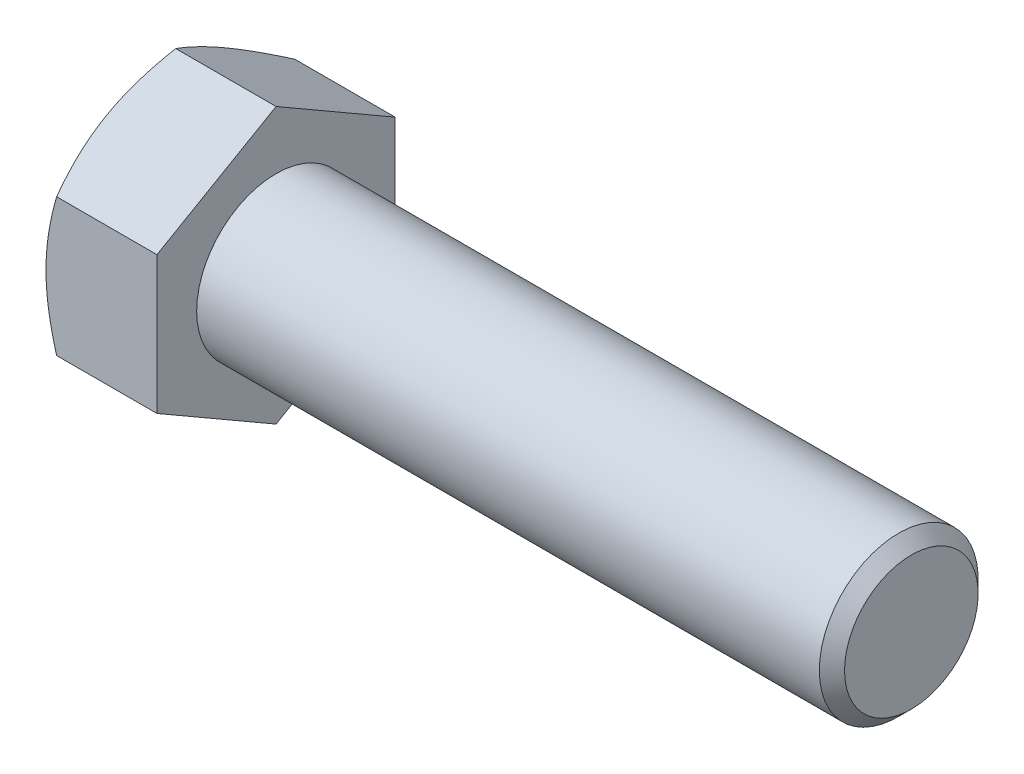
ISO-10303-21;
HEADER;
FILE_DESCRIPTION(('STEP AP214'),'2;1');
FILE_NAME('part.step','',(''),(''),'','','');
FILE_SCHEMA(('AUTOMOTIVE_DESIGN { 1 0 10303 214 1 1 1 1 }'));
ENDSEC;
DATA;
#1=APPLICATION_CONTEXT('core data for automotive mechanical design processes');
#2=APPLICATION_PROTOCOL_DEFINITION('international standard','automotive_design',2000,#1);
#3=PRODUCT_CONTEXT('',#1,'mechanical');
#4=PRODUCT('Part','Part','',(#3));
#5=PRODUCT_RELATED_PRODUCT_CATEGORY('part','',(#4));
#6=PRODUCT_DEFINITION_FORMATION('','',#4);
#7=PRODUCT_DEFINITION_CONTEXT('part definition',#1,'design');
#8=PRODUCT_DEFINITION('design','',#6,#7);
#9=PRODUCT_DEFINITION_SHAPE('','',#8);
#10=(LENGTH_UNIT() NAMED_UNIT(*) SI_UNIT(.MILLI.,.METRE.));
#11=(NAMED_UNIT(*) PLANE_ANGLE_UNIT() SI_UNIT($,.RADIAN.));
#12=(NAMED_UNIT(*) SI_UNIT($,.STERADIAN.) SOLID_ANGLE_UNIT());
#13=UNCERTAINTY_MEASURE_WITH_UNIT(LENGTH_MEASURE(1.E-05),#10,'distance_accuracy_value','');
#14=(GEOMETRIC_REPRESENTATION_CONTEXT(3) GLOBAL_UNCERTAINTY_ASSIGNED_CONTEXT((#13)) GLOBAL_UNIT_ASSIGNED_CONTEXT((#10,
#11,#12)) REPRESENTATION_CONTEXT('',''));
#15=CARTESIAN_POINT('',(0.,0.,0.));
#16=DIRECTION('',(0.,0.,1.));
#17=DIRECTION('',(1.,0.,0.));
#18=AXIS2_PLACEMENT_3D('',#15,#16,#17);
#19=CARTESIAN_POINT('',(13.3096,8.24889197104677,-14.2875));
#20=DIRECTION('',(0.,-0.866025403784438,0.5));
#21=DIRECTION('',(0.,-0.5,-0.866025403784438));
#22=AXIS2_PLACEMENT_3D('',#19,#20,#21);
#23=PLANE('',#22);
#24=CARTESIAN_POINT('',(1.2761746963198,16.4978994121474,0.0002));
#25=CARTESIAN_POINT('',(1.17150354049374,16.316591962665,-0.313833714294314));
#26=CARTESIAN_POINT('',(1.07158215537579,16.1345773166767,-0.629092328867607));
#27=CARTESIAN_POINT('',(0.882559201585307,15.7690884807822,-1.26213756223605));
#28=CARTESIAN_POINT('',(0.793461191524302,15.5856138318553,-1.5799249760784));
#29=CARTESIAN_POINT('',(0.627282646740068,15.2168504028066,-2.21864197116398));
#30=CARTESIAN_POINT('',(0.550230545696853,15.0315583957425,-2.53957714163546));
#31=CARTESIAN_POINT('',(0.409798352887989,14.6596868248225,-3.18367759635941));
#32=CARTESIAN_POINT('',(0.346417481149996,14.4731073350473,-3.50684275230036));
#33=CARTESIAN_POINT('',(0.236023554267069,14.1034416805247,-4.14712244774659));
#34=CARTESIAN_POINT('',(0.188645115273865,13.9203829601652,-4.46418945217785));
#35=CARTESIAN_POINT('',(0.109201912674412,13.5534267067704,-5.09977632721271));
#36=CARTESIAN_POINT('',(0.0771374438271076,13.3695291576584,-5.41829622566207));
#37=CARTESIAN_POINT('',(0.0291317909883735,13.0014251352584,-6.05587109492942));
#38=CARTESIAN_POINT('',(0.0131714475146437,12.8172192908535,-6.37492497648983));
#39=CARTESIAN_POINT('',(-0.00228271550063057,12.448637559964,-7.01332726113216));
#40=CARTESIAN_POINT('',(-0.00177704383827127,12.2642616789095,-7.33267565480881));
#41=CARTESIAN_POINT('',(0.0145506803037095,11.9195719861559,-7.92969571550333));
#42=CARTESIAN_POINT('',(0.0283811431962141,11.759233611051,-8.20740992758799));
#43=CARTESIAN_POINT('',(0.0682339694513751,11.4389256760858,-8.76219954501513));
#44=CARTESIAN_POINT('',(0.0942571951847596,11.2789561431174,-9.03927490377954));
#45=CARTESIAN_POINT('',(0.158041814881286,10.9594727825021,-9.59263631653807));
#46=CARTESIAN_POINT('',(0.195812903582829,10.7999594414437,-9.86892152773624));
#47=CARTESIAN_POINT('',(0.282430562472694,10.4816805882453,-10.4201966724507));
#48=CARTESIAN_POINT('',(0.331277885597339,10.3229151276936,-10.6951865166133));
#49=CARTESIAN_POINT('',(0.495669002146555,9.84097374681805,-11.5299334745597));
#50=CARTESIAN_POINT('',(0.627604309461495,9.51919345055701,-12.0872732965584));
#51=CARTESIAN_POINT('',(0.927043495545048,8.88043099732144,-13.1936423195297));
#52=CARTESIAN_POINT('',(1.09447704990011,8.56344066203608,-13.7426856857522));
#53=CARTESIAN_POINT('',(1.27617469631978,8.24877650099293,-14.2877));
#54=B_SPLINE_CURVE_WITH_KNOTS('',3,(#24,#25,#26,#27,#28,#29,#30,#31,#32,#33,#34,#35,#36,#37,#38,
#39,#40,#41,#42,#43,#44,#45,#46,#47,#48,#49,#50,#51,#52,#53),.UNSPECIFIED.,.F.,.F.,(4,2,2,2,2,2,
2,2,2,2,2,2,2,2,4),(0.,1.1322886698782,2.26494862244556,3.40024304981971,4.53547268912058,
5.64268215336774,6.74991292800918,7.85582484363027,8.9617025868589,9.92439507576008,
10.8871556643353,11.8507128733959,12.8143356024524,14.7839571212635,16.7497125507192),.UNSPECIFIED.);
#55=CARTESIAN_POINT('',(1.27610802895322,16.4977839420936,0.));
#56=VERTEX_POINT('',#55);
#57=CARTESIAN_POINT('',(0.,12.3733379565702,-7.14375));
#58=VERTEX_POINT('',#57);
#59=EDGE_CURVE('E33',#56,#58,#54,.T.);
#60=ORIENTED_EDGE('',*,*,#59,.F.);
#61=DIRECTION('',(-1.,0.,0.));
#62=VECTOR('',#61,1.);
#63=CARTESIAN_POINT('',(13.3096,16.4977839420936,0.));
#64=LINE('',#63,#62);
#65=CARTESIAN_POINT('',(13.3096,16.4977839420936,0.));
#66=VERTEX_POINT('',#65);
#67=EDGE_CURVE('E129',#66,#56,#64,.T.);
#68=ORIENTED_EDGE('',*,*,#67,.F.);
#69=DIRECTION('',(0.,0.5,0.866025403784438));
#70=VECTOR('',#69,1.);
#71=CARTESIAN_POINT('',(13.3096,8.24889197104677,-14.2875));
#72=LINE('',#71,#70);
#73=CARTESIAN_POINT('',(13.3096,8.24889197104677,-14.2875));
#74=VERTEX_POINT('',#73);
#75=EDGE_CURVE('E214',#74,#66,#72,.T.);
#76=ORIENTED_EDGE('',*,*,#75,.F.);
#77=DIRECTION('',(-1.,0.,0.));
#78=VECTOR('',#77,1.);
#79=CARTESIAN_POINT('',(13.3096,8.24889197104677,-14.2875));
#80=LINE('',#79,#78);
#81=CARTESIAN_POINT('',(1.27610802895321,8.24889197104677,-14.2875));
#82=VERTEX_POINT('',#81);
#83=EDGE_CURVE('E117',#74,#82,#80,.T.);
#84=ORIENTED_EDGE('',*,*,#83,.T.);
#85=EDGE_CURVE('E111',#58,#82,#54,.T.);
#86=ORIENTED_EDGE('',*,*,#85,.F.);
#87=EDGE_LOOP('',(#60,#68,#76,#84,#86));
#88=FACE_BOUND('',#87,.T.);
#89=ADVANCED_FACE('F17',(#88),#23,.F.);
#90=CARTESIAN_POINT('',(13.3096,16.4977839420936,0.));
#91=DIRECTION('',(0.,-0.866025403784438,-0.5));
#92=DIRECTION('',(0.,0.5,-0.866025403784438));
#93=AXIS2_PLACEMENT_3D('',#90,#91,#92);
#94=PLANE('',#93);
#95=CARTESIAN_POINT('',(1.27617469631979,8.24877650099293,14.2877));
#96=CARTESIAN_POINT('',(1.17150354049373,8.43008395047537,13.9736662857057));
#97=CARTESIAN_POINT('',(1.07158215537578,8.61209859646361,13.6584076711324));
#98=CARTESIAN_POINT('',(0.882559201585304,8.97758743235809,13.0253624377639));
#99=CARTESIAN_POINT('',(0.793461191524299,9.16106208128505,12.7075750239216));
#100=CARTESIAN_POINT('',(0.627282646740065,9.52982551033369,12.068858028836));
#101=CARTESIAN_POINT('',(0.550230545696849,9.71511751739782,11.7479228583645));
#102=CARTESIAN_POINT('',(0.409798352887985,10.0869890883179,11.1038224036406));
#103=CARTESIAN_POINT('',(0.346417481149992,10.2735685780931,10.7806572476996));
#104=CARTESIAN_POINT('',(0.236023554267066,10.6432342326156,10.1403775522534));
#105=CARTESIAN_POINT('',(0.188645115273863,10.8262929529751,9.82331054782214));
#106=CARTESIAN_POINT('',(0.109201912674409,11.1932492063699,9.18772367278729));
#107=CARTESIAN_POINT('',(0.0771374438271045,11.3771467554819,8.86920377433793));
#108=CARTESIAN_POINT('',(0.0291317909883698,11.7452507778819,8.23162890507058));
#109=CARTESIAN_POINT('',(0.0131714475146401,11.9294566222868,7.91257502351017));
#110=CARTESIAN_POINT('',(-0.00228271550063099,12.2980383531764,7.27417273886784));
#111=CARTESIAN_POINT('',(-0.00177704383826868,12.4824142342309,6.9548243451912));
#112=CARTESIAN_POINT('',(0.0145506803037115,12.8271039269845,6.35780428449668));
#113=CARTESIAN_POINT('',(0.0283811431962134,12.9874423020893,6.08009007241201));
#114=CARTESIAN_POINT('',(0.0682339694513723,13.3077502370545,5.52530045498486));
#115=CARTESIAN_POINT('',(0.0942571951847574,13.4677197700229,5.24822509622045));
#116=CARTESIAN_POINT('',(0.158041814881285,13.7872031306382,4.69486368346192));
#117=CARTESIAN_POINT('',(0.195812903582828,13.9467164716966,4.41857847226375));
#118=CARTESIAN_POINT('',(0.282430562472694,14.264995324895,3.86730332754926));
#119=CARTESIAN_POINT('',(0.331277885597339,14.4237607854467,3.59231348338673));
#120=CARTESIAN_POINT('',(0.495669002146555,14.9057021663223,2.75756652544034));
#121=CARTESIAN_POINT('',(0.627604309461494,15.2274824625833,2.20022670344164));
#122=CARTESIAN_POINT('',(0.927043495545049,15.8662449158189,1.09385768047029));
#123=CARTESIAN_POINT('',(1.09447704990012,16.1832352511043,0.544814314247752));
#124=CARTESIAN_POINT('',(1.2761746963198,16.4978994121474,-0.000200000000000018));
#125=B_SPLINE_CURVE_WITH_KNOTS('',3,(#95,#96,#97,#98,#99,#100,#101,#102,#103,#104,#105,#106,
#107,#108,#109,#110,#111,#112,#113,#114,#115,#116,#117,#118,#119,#120,#121,#122,#123,#124),
.UNSPECIFIED.,.F.,.F.,(4,2,2,2,2,2,2,2,2,2,2,2,2,2,4),(0.,1.1322886698782,2.26494862244556,
3.4002430498197,4.53547268912058,5.64268215336774,6.74991292800918,7.85582484363026,
8.96170258685889,9.92439507576008,10.8871556643353,11.8507128733959,12.8143356024524,
14.7839571212635,16.7497125507192),.UNSPECIFIED.);
#126=CARTESIAN_POINT('',(1.27610802895321,8.24889197104677,14.2875));
#127=VERTEX_POINT('',#126);
#128=CARTESIAN_POINT('',(0.,12.3733379565702,7.14375));
#129=VERTEX_POINT('',#128);
#130=EDGE_CURVE('E40',#127,#129,#125,.T.);
#131=ORIENTED_EDGE('',*,*,#130,.F.);
#132=DIRECTION('',(-1.,0.,0.));
#133=VECTOR('',#132,1.);
#134=CARTESIAN_POINT('',(13.3096,8.24889197104677,14.2875));
#135=LINE('',#134,#133);
#136=CARTESIAN_POINT('',(13.3096,8.24889197104677,14.2875));
#137=VERTEX_POINT('',#136);
#138=EDGE_CURVE('E127',#137,#127,#135,.T.);
#139=ORIENTED_EDGE('',*,*,#138,.F.);
#140=DIRECTION('',(0.,-0.5,0.866025403784438));
#141=VECTOR('',#140,1.);
#142=CARTESIAN_POINT('',(13.3096,16.4977839420936,0.));
#143=LINE('',#142,#141);
#144=EDGE_CURVE('E212',#66,#137,#143,.T.);
#145=ORIENTED_EDGE('',*,*,#144,.F.);
#146=ORIENTED_EDGE('',*,*,#67,.T.);
#147=EDGE_CURVE('E144',#129,#56,#125,.T.);
#148=ORIENTED_EDGE('',*,*,#147,.F.);
#149=EDGE_LOOP('',(#131,#139,#145,#146,#148));
#150=FACE_BOUND('',#149,.T.);
#151=ADVANCED_FACE('F150',(#150),#94,.F.);
#152=CARTESIAN_POINT('',(13.3096,8.24889197104677,14.2875));
#153=DIRECTION('',(0.,0.,-1.));
#154=DIRECTION('',(0.,1.,0.));
#155=AXIS2_PLACEMENT_3D('',#152,#153,#154);
#156=PLANE('',#155);
#157=CARTESIAN_POINT('',(7.08559653091284,-22.3898851403976,14.2875));
#158=CARTESIAN_POINT('',(6.93326774728015,-22.0768961485065,14.2875));
#159=CARTESIAN_POINT('',(6.78168115524726,-21.7635461076253,14.2875));
#160=CARTESIAN_POINT('',(6.48015999479452,-21.1360486675518,14.2875));
#161=CARTESIAN_POINT('',(6.33022544229007,-20.8219012607137,14.2875));
#162=CARTESIAN_POINT('',(5.88311326936992,-19.8780695997121,14.2875));
#163=CARTESIAN_POINT('',(5.5886705911187,-19.2470849579339,14.2875));
#164=CARTESIAN_POINT('',(5.00727922083416,-17.9776461473272,14.2875));
#165=CARTESIAN_POINT('',(4.72037808476412,-17.3391701473184,14.2875));
#166=CARTESIAN_POINT('',(4.15800525940536,-16.0572214756456,14.2875));
#167=CARTESIAN_POINT('',(3.88253304540859,-15.4137490349848,14.2875));
#168=CARTESIAN_POINT('',(3.33703966758478,-14.0991063623122,14.2875));
#169=CARTESIAN_POINT('',(3.06751087102777,-13.427730783812,14.2875));
#170=CARTESIAN_POINT('',(2.5482941470189,-12.0772064856565,14.2875));
#171=CARTESIAN_POINT('',(2.29860841369513,-11.3980569158718,14.2875));
#172=CARTESIAN_POINT('',(1.82546713347175,-10.0321237241471,14.2875));
#173=CARTESIAN_POINT('',(1.60196042520996,-9.34535796384211,14.2875));
#174=CARTESIAN_POINT('',(1.18818152853813,-7.96191308991342,14.2875));
#175=CARTESIAN_POINT('',(0.997899114310358,-7.26523709812128,14.2875));
#176=CARTESIAN_POINT('',(0.744688974538716,-6.21459800125067,14.2875));
#177=CARTESIAN_POINT('',(0.665833592890646,-5.8644518116812,14.2875));
#178=CARTESIAN_POINT('',(0.519775761529062,-5.16172478937003,14.2875));
#179=CARTESIAN_POINT('',(0.452573084094936,-4.80914400434595,14.2875));
#180=CARTESIAN_POINT('',(0.330991997803052,-4.10177331465976,14.2875));
#181=CARTESIAN_POINT('',(0.276613366867467,-3.74698344836218,14.2875));
#182=CARTESIAN_POINT('',(0.181756259237046,-3.03555342863082,14.2875));
#183=CARTESIAN_POINT('',(0.141277163865966,-2.67891335826814,14.2875));
#184=CARTESIAN_POINT('',(0.07554365004543,-1.96903610663558,14.2875));
#185=CARTESIAN_POINT('',(0.0500928077740648,-1.61581722652351,14.2875));
#186=CARTESIAN_POINT('',(0.0141622343995991,-0.908619532356741,14.2875));
#187=CARTESIAN_POINT('',(0.00368224833251656,-0.554640731346855,14.2875));
#188=CARTESIAN_POINT('',(-0.00205625515740651,0.153442979231283,14.2875));
#189=CARTESIAN_POINT('',(0.00268522427340274,0.507547888773452,14.2875));
#190=CARTESIAN_POINT('',(0.0272712917644408,1.2152373445244,14.2875));
#191=CARTESIAN_POINT('',(0.0471165519035033,1.5688218668758,14.2875));
#192=CARTESIAN_POINT('',(0.111996031071714,2.41165837977564,14.2875));
#193=CARTESIAN_POINT('',(0.163810406450373,2.90039811194565,14.2875));
#194=CARTESIAN_POINT('',(0.293528569466133,3.87440480488913,14.2875));
#195=CARTESIAN_POINT('',(0.371435712647268,4.35967131080169,14.2875));
#196=CARTESIAN_POINT('',(0.550568352001128,5.32621625313486,14.2875));
#197=CARTESIAN_POINT('',(0.651811306760682,5.80749142276731,14.2875));
#198=CARTESIAN_POINT('',(0.874513374276023,6.76529068673461,14.2875));
#199=CARTESIAN_POINT('',(0.995972236678844,7.2418148398284,14.2875));
#200=CARTESIAN_POINT('',(1.259051674178,8.20075205778832,14.2875));
#201=CARTESIAN_POINT('',(1.40106388456013,8.68305692684694,14.2875));
#202=CARTESIAN_POINT('',(1.70023403432788,9.64291929226156,14.2875));
#203=CARTESIAN_POINT('',(1.85739207777891,10.1204767559738,14.2875));
#204=CARTESIAN_POINT('',(2.18431745757465,11.071072312766,14.2875));
#205=CARTESIAN_POINT('',(2.35408093456884,11.5441117394621,14.2875));
#206=CARTESIAN_POINT('',(2.70417375232531,12.4862394675866,14.2875));
#207=CARTESIAN_POINT('',(2.8845029427673,12.955327825119,14.2875));
#208=CARTESIAN_POINT('',(3.33642274249976,14.0985450123052,14.2875));
#209=CARTESIAN_POINT('',(3.61283070485536,14.7707670956111,14.2875));
#210=CARTESIAN_POINT('',(4.17998789378481,16.1091534086177,14.2875));
#211=CARTESIAN_POINT('',(4.47073818030502,16.7753171862674,14.2875));
#212=CARTESIAN_POINT('',(5.06358550000994,18.1027741716843,14.2875));
#213=CARTESIAN_POINT('',(5.36568552575699,18.7640660391257,14.2875));
#214=CARTESIAN_POINT('',(5.978840380942,20.0824528287766,14.2875));
#215=CARTESIAN_POINT('',(6.28989497805703,20.7395478593321,14.2875));
#216=CARTESIAN_POINT('',(6.91960732570603,22.0510812939212,14.2875));
#217=CARTESIAN_POINT('',(7.23827402908065,22.7055153913756,14.2875));
#218=CARTESIAN_POINT('',(7.88149356008954,24.0114843998787,14.2875));
#219=CARTESIAN_POINT('',(8.20604641853122,24.663019295731,14.2875));
#220=CARTESIAN_POINT('',(8.85994319829524,25.9635553617577,14.2875));
#221=CARTESIAN_POINT('',(9.18928639403451,26.6125568971502,14.2875));
#222=CARTESIAN_POINT('',(9.85199752739624,27.9084978324256,14.2875));
#223=CARTESIAN_POINT('',(10.1853654561409,28.555437236853,14.2875));
#224=CARTESIAN_POINT('',(11.1306522678145,30.3782153849138,14.2875));
#225=CARTESIAN_POINT('',(11.7464658067759,31.5520342270543,14.2875));
#226=CARTESIAN_POINT('',(12.9863637492688,33.8953480220263,14.2875));
#227=CARTESIAN_POINT('',(13.6104484992592,35.0648427910931,14.2875));
#228=CARTESIAN_POINT('',(14.8631697843525,37.3972192211192,14.2875));
#229=CARTESIAN_POINT('',(15.4917889329957,38.5601102267932,14.2875));
#230=CARTESIAN_POINT('',(16.4383496296699,40.3024250307733,14.2875));
#231=CARTESIAN_POINT('',(16.7544655515047,40.8828421143772,14.2875));
#232=CARTESIAN_POINT('',(17.3877853934411,42.0430813057571,14.2875));
#233=CARTESIAN_POINT('',(17.7049893118937,42.6229034144332,14.2875));
#234=CARTESIAN_POINT('',(18.0226732632783,43.2024624684083,14.2875));
#235=B_SPLINE_CURVE_WITH_KNOTS('',3,(#157,#158,#159,#160,#161,#162,#163,#164,#165,#166,#167,
#168,#169,#170,#171,#172,#173,#174,#175,#176,#177,#178,#179,#180,#181,#182,#183,#184,#185,#186,
#187,#188,#189,#190,#191,#192,#193,#194,#195,#196,#197,#198,#199,#200,#201,#202,#203,#204,#205,
#206,#207,#208,#209,#210,#211,#212,#213,#214,#215,#216,#217,#218,#219,#220,#221,#222,#223,#224,
#225,#226,#227,#228,#229,#230,#231,#232,#233,#234),.UNSPECIFIED.,.F.,.F.,(4,2,2,2,2,2,2,2,2,2,2,
2,2,2,2,2,2,2,2,2,2,2,2,2,2,2,2,2,2,2,2,2,2,2,2,2,2,2,4),(0.,1.04426611026884,2.08854227199574,
4.17739185153995,6.27722701936104,8.37696567568249,10.5470989949833,12.7174719418313,
14.8835299683505,17.048920142941,18.1255049291752,19.2020686740974,20.2786137744758,
21.3551109510055,22.4172073060167,23.4792855725806,24.5413636196078,25.6034889291002,
27.0771146749695,28.5509300027185,30.0258515587195,31.5007548507115,33.0087918261306,
34.5168391638508,36.024426678107,37.5319927488533,39.7122554194619,41.8926794609792,
44.0736825017389,46.2546290081198,48.4382809122898,50.6219442487211,52.8052802048644,
54.9886113458608,58.9652044042268,62.9419645611425,66.9077143187838,68.8904689713397,
70.8732206202618),.UNSPECIFIED.);
#236=CARTESIAN_POINT('',(1.2761080289532,-8.24889197104674,14.2875));
#237=VERTEX_POINT('',#236);
#238=CARTESIAN_POINT('',(0.,0.,14.2875));
#239=VERTEX_POINT('',#238);
#240=EDGE_CURVE('E224',#237,#239,#235,.T.);
#241=ORIENTED_EDGE('',*,*,#240,.F.);
#242=DIRECTION('',(-1.,0.,0.));
#243=VECTOR('',#242,1.);
#244=CARTESIAN_POINT('',(13.3096,-8.24889197104674,14.2875));
#245=LINE('',#244,#243);
#246=CARTESIAN_POINT('',(13.3096,-8.24889197104674,14.2875));
#247=VERTEX_POINT('',#246);
#248=EDGE_CURVE('E119',#247,#237,#245,.T.);
#249=ORIENTED_EDGE('',*,*,#248,.F.);
#250=DIRECTION('',(0.,-1.,0.));
#251=VECTOR('',#250,1.);
#252=CARTESIAN_POINT('',(13.3096,8.24889197104677,14.2875));
#253=LINE('',#252,#251);
#254=EDGE_CURVE('E208',#137,#247,#253,.T.);
#255=ORIENTED_EDGE('',*,*,#254,.F.);
#256=ORIENTED_EDGE('',*,*,#138,.T.);
#257=EDGE_CURVE('E166',#239,#127,#235,.T.);
#258=ORIENTED_EDGE('',*,*,#257,.F.);
#259=EDGE_LOOP('',(#241,#249,#255,#256,#258));
#260=FACE_BOUND('',#259,.T.);
#261=ADVANCED_FACE('F230',(#260),#156,.F.);
#262=CARTESIAN_POINT('',(13.3096,-16.4977839420936,0.));
#263=DIRECTION('',(0.,0.866025403784437,-0.5));
#264=DIRECTION('',(0.,0.5,0.866025403784438));
#265=AXIS2_PLACEMENT_3D('',#262,#263,#264);
#266=PLANE('',#265);
#267=CARTESIAN_POINT('',(1.27617469631979,-16.4978994121474,-0.000200000000000067));
#268=CARTESIAN_POINT('',(1.17150354049374,-16.316591962665,0.313833714294314));
#269=CARTESIAN_POINT('',(1.07158215537578,-16.1345773166767,0.629092328867607));
#270=CARTESIAN_POINT('',(0.882559201585304,-15.7690884807822,1.26213756223605));
#271=CARTESIAN_POINT('',(0.7934611915243,-15.5856138318553,1.5799249760784));
#272=CARTESIAN_POINT('',(0.627282646740066,-15.2168504028066,2.21864197116398));
#273=CARTESIAN_POINT('',(0.55023054569685,-15.0315583957425,2.53957714163545));
#274=CARTESIAN_POINT('',(0.409798352887985,-14.6596868248225,3.18367759635941));
#275=CARTESIAN_POINT('',(0.346417481149992,-14.4731073350472,3.50684275230036));
#276=CARTESIAN_POINT('',(0.236023554267065,-14.1034416805247,4.14712244774659));
#277=CARTESIAN_POINT('',(0.188645115273861,-13.9203829601652,4.46418945217785));
#278=CARTESIAN_POINT('',(0.109201912674408,-13.5534267067704,5.0997763272127));
#279=CARTESIAN_POINT('',(0.077137443827102,-13.3695291576584,5.41829622566206));
#280=CARTESIAN_POINT('',(0.0291317909883685,-13.0014251352584,6.05587109492942));
#281=CARTESIAN_POINT('',(0.0131714475146407,-12.8172192908535,6.37492497648983));
#282=CARTESIAN_POINT('',(-0.00228271550063465,-12.448637559964,7.01332726113215));
#283=CARTESIAN_POINT('',(-0.00177704383827856,-12.2642616789095,7.3326756548088));
#284=CARTESIAN_POINT('',(0.0145506803037023,-11.9195719861559,7.92969571550332));
#285=CARTESIAN_POINT('',(0.0283811431962094,-11.759233611051,8.20740992758799));
#286=CARTESIAN_POINT('',(0.0682339694513716,-11.4389256760858,8.76219954501513));
#287=CARTESIAN_POINT('',(0.0942571951847547,-11.2789561431174,9.03927490377954));
#288=CARTESIAN_POINT('',(0.158041814881281,-10.9594727825021,9.59263631653807));
#289=CARTESIAN_POINT('',(0.195812903582825,-10.7999594414437,9.86892152773624));
#290=CARTESIAN_POINT('',(0.282430562472691,-10.4816805882453,10.4201966724507));
#291=CARTESIAN_POINT('',(0.331277885597336,-10.3229151276936,10.6951865166133));
#292=CARTESIAN_POINT('',(0.495669002146552,-9.84097374681804,11.5299334745597));
#293=CARTESIAN_POINT('',(0.627604309461491,-9.519193450557,12.0872732965584));
#294=CARTESIAN_POINT('',(0.927043495545044,-8.88043099732142,13.1936423195297));
#295=CARTESIAN_POINT('',(1.09447704990011,-8.56344066203605,13.7426856857522));
#296=CARTESIAN_POINT('',(1.27617469631978,-8.2487765009929,14.2877));
#297=B_SPLINE_CURVE_WITH_KNOTS('',3,(#267,#268,#269,#270,#271,#272,#273,#274,#275,#276,#277,
#278,#279,#280,#281,#282,#283,#284,#285,#286,#287,#288,#289,#290,#291,#292,#293,#294,#295,#296),
.UNSPECIFIED.,.F.,.F.,(4,2,2,2,2,2,2,2,2,2,2,2,2,2,4),(0.,1.13228866987821,2.26494862244556,
3.40024304981971,4.53547268912058,5.64268215336775,6.74991292800918,7.85582484363027,
8.96170258685889,9.92439507576008,10.8871556643353,11.8507128733959,12.8143356024524,
14.7839571212635,16.7497125507192),.UNSPECIFIED.);
#298=CARTESIAN_POINT('',(1.27610802895322,-16.4977839420936,0.));
#299=VERTEX_POINT('',#298);
#300=CARTESIAN_POINT('',(0.,-12.3733379565701,7.14375));
#301=VERTEX_POINT('',#300);
#302=EDGE_CURVE('E152',#299,#301,#297,.T.);
#303=ORIENTED_EDGE('',*,*,#302,.F.);
#304=DIRECTION('',(-1.,0.,0.));
#305=VECTOR('',#304,1.);
#306=CARTESIAN_POINT('',(13.3096,-16.4977839420936,0.));
#307=LINE('',#306,#305);
#308=CARTESIAN_POINT('',(13.3096,-16.4977839420936,0.));
#309=VERTEX_POINT('',#308);
#310=EDGE_CURVE('E116',#309,#299,#307,.T.);
#311=ORIENTED_EDGE('',*,*,#310,.F.);
#312=DIRECTION('',(0.,-0.5,-0.866025403784438));
#313=VECTOR('',#312,1.);
#314=CARTESIAN_POINT('',(13.3096,-16.4977839420936,0.));
#315=LINE('',#314,#313);
#316=EDGE_CURVE('E206',#247,#309,#315,.T.);
#317=ORIENTED_EDGE('',*,*,#316,.F.);
#318=ORIENTED_EDGE('',*,*,#248,.T.);
#319=EDGE_CURVE('E154',#301,#237,#297,.T.);
#320=ORIENTED_EDGE('',*,*,#319,.F.);
#321=EDGE_LOOP('',(#303,#311,#317,#318,#320));
#322=FACE_BOUND('',#321,.T.);
#323=ADVANCED_FACE('F202',(#322),#266,.F.);
#324=CARTESIAN_POINT('',(13.3096,-8.24889197104679,-14.2875));
#325=DIRECTION('',(0.,0.866025403784439,0.5));
#326=DIRECTION('',(0.,-0.5,0.866025403784439));
#327=AXIS2_PLACEMENT_3D('',#324,#325,#326);
#328=PLANE('',#327);
#329=CARTESIAN_POINT('',(1.27617469631979,-8.24877650099295,-14.2877));
#330=CARTESIAN_POINT('',(1.17150354049374,-8.43008395047539,-13.9736662857057));
#331=CARTESIAN_POINT('',(1.07158215537579,-8.61209859646363,-13.6584076711324));
#332=CARTESIAN_POINT('',(0.882559201585312,-8.97758743235811,-13.0253624377639));
#333=CARTESIAN_POINT('',(0.793461191524306,-9.16106208128507,-12.7075750239216));
#334=CARTESIAN_POINT('',(0.627282646740073,-9.52982551033372,-12.068858028836));
#335=CARTESIAN_POINT('',(0.550230545696858,-9.71511751739784,-11.7479228583645));
#336=CARTESIAN_POINT('',(0.409798352887994,-10.0869890883179,-11.1038224036406));
#337=CARTESIAN_POINT('',(0.346417481150001,-10.2735685780931,-10.7806572476996));
#338=CARTESIAN_POINT('',(0.236023554267074,-10.6432342326156,-10.1403775522534));
#339=CARTESIAN_POINT('',(0.18864511527387,-10.8262929529752,-9.82331054782214));
#340=CARTESIAN_POINT('',(0.109201912674418,-11.1932492063699,-9.18772367278729));
#341=CARTESIAN_POINT('',(0.0771374438271129,-11.3771467554819,-8.86920377433793));
#342=CARTESIAN_POINT('',(0.0291317909883797,-11.745250777882,-8.23162890507058));
#343=CARTESIAN_POINT('',(0.0131714475146514,-11.9294566222869,-7.91257502351017));
#344=CARTESIAN_POINT('',(-0.00228271550062322,-12.2980383531764,-7.27417273886784));
#345=CARTESIAN_POINT('',(-0.00177704383826574,-12.4824142342309,-6.95482434519119));
#346=CARTESIAN_POINT('',(0.0145506803037151,-12.8271039269845,-6.35780428449667));
#347=CARTESIAN_POINT('',(0.0283811431962211,-12.9874423020893,-6.080090072412));
#348=CARTESIAN_POINT('',(0.068233969451383,-13.3077502370545,-5.52530045498486));
#349=CARTESIAN_POINT('',(0.094257195184767,-13.4677197700229,-5.24822509622046));
#350=CARTESIAN_POINT('',(0.158041814881294,-13.7872031306382,-4.69486368346192));
#351=CARTESIAN_POINT('',(0.195812903582837,-13.9467164716966,-4.41857847226376));
#352=CARTESIAN_POINT('',(0.282430562472703,-14.2649953248951,-3.86730332754926));
#353=CARTESIAN_POINT('',(0.331277885597348,-14.4237607854467,-3.59231348338674));
#354=CARTESIAN_POINT('',(0.495669002146563,-14.9057021663223,-2.75756652544034));
#355=CARTESIAN_POINT('',(0.627604309461502,-15.2274824625833,-2.20022670344164));
#356=CARTESIAN_POINT('',(0.927043495545053,-15.8662449158189,-1.0938576804703));
#357=CARTESIAN_POINT('',(1.09447704990012,-16.1832352511043,-0.544814314247759));
#358=CARTESIAN_POINT('',(1.27617469631979,-16.4978994121474,0.000200000000000897));
#359=B_SPLINE_CURVE_WITH_KNOTS('',3,(#329,#330,#331,#332,#333,#334,#335,#336,#337,#338,#339,
#340,#341,#342,#343,#344,#345,#346,#347,#348,#349,#350,#351,#352,#353,#354,#355,#356,#357,#358),
.UNSPECIFIED.,.F.,.F.,(4,2,2,2,2,2,2,2,2,2,2,2,2,2,4),(0.,1.13228866987821,2.26494862244556,
3.4002430498197,4.53547268912058,5.64268215336774,6.74991292800917,7.85582484363026,
8.96170258685889,9.92439507576008,10.8871556643353,11.8507128733959,12.8143356024524,
14.7839571212635,16.7497125507192),.UNSPECIFIED.);
#360=CARTESIAN_POINT('',(1.27610802895322,-8.24889197104679,-14.2875));
#361=VERTEX_POINT('',#360);
#362=CARTESIAN_POINT('',(0.,-12.3733379565702,-7.14375));
#363=VERTEX_POINT('',#362);
#364=EDGE_CURVE('E93',#361,#363,#359,.T.);
#365=ORIENTED_EDGE('',*,*,#364,.F.);
#366=DIRECTION('',(-1.,0.,0.));
#367=VECTOR('',#366,1.);
#368=CARTESIAN_POINT('',(13.3096,-8.24889197104679,-14.2875));
#369=LINE('',#368,#367);
#370=CARTESIAN_POINT('',(13.3096,-8.24889197104679,-14.2875));
#371=VERTEX_POINT('',#370);
#372=EDGE_CURVE('E107',#371,#361,#369,.T.);
#373=ORIENTED_EDGE('',*,*,#372,.F.);
#374=DIRECTION('',(0.,0.5,-0.866025403784439));
#375=VECTOR('',#374,1.);
#376=CARTESIAN_POINT('',(13.3096,-8.24889197104679,-14.2875));
#377=LINE('',#376,#375);
#378=EDGE_CURVE('E204',#309,#371,#377,.T.);
#379=ORIENTED_EDGE('',*,*,#378,.F.);
#380=ORIENTED_EDGE('',*,*,#310,.T.);
#381=EDGE_CURVE('E110',#363,#299,#359,.T.);
#382=ORIENTED_EDGE('',*,*,#381,.F.);
#383=EDGE_LOOP('',(#365,#373,#379,#380,#382));
#384=FACE_BOUND('',#383,.T.);
#385=ADVANCED_FACE('F105',(#384),#328,.F.);
#386=CARTESIAN_POINT('',(13.3096,8.24889197104677,-14.2875));
#387=DIRECTION('',(0.,0.,1.));
#388=DIRECTION('',(0.,-1.,0.));
#389=AXIS2_PLACEMENT_3D('',#386,#387,#388);
#390=PLANE('',#389);
#391=CARTESIAN_POINT('',(7.08559653091287,-22.3898851403977,-14.2875));
#392=CARTESIAN_POINT('',(6.93326774728018,-22.0768961485065,-14.2875));
#393=CARTESIAN_POINT('',(6.78168115524728,-21.7635461076253,-14.2875));
#394=CARTESIAN_POINT('',(6.48015999479454,-21.1360486675519,-14.2875));
#395=CARTESIAN_POINT('',(6.3302254422901,-20.8219012607137,-14.2875));
#396=CARTESIAN_POINT('',(5.88311326936994,-19.8780695997121,-14.2875));
#397=CARTESIAN_POINT('',(5.58867059111872,-19.247084957934,-14.2875));
#398=CARTESIAN_POINT('',(5.00727922083418,-17.9776461473273,-14.2875));
#399=CARTESIAN_POINT('',(4.72037808476414,-17.3391701473184,-14.2875));
#400=CARTESIAN_POINT('',(4.15800525940538,-16.0572214756457,-14.2875));
#401=CARTESIAN_POINT('',(3.88253304540861,-15.4137490349849,-14.2875));
#402=CARTESIAN_POINT('',(3.33703966758481,-14.0991063623123,-14.2875));
#403=CARTESIAN_POINT('',(3.0675108710278,-13.427730783812,-14.2875));
#404=CARTESIAN_POINT('',(2.54829414701892,-12.0772064856565,-14.2875));
#405=CARTESIAN_POINT('',(2.29860841369515,-11.3980569158718,-14.2875));
#406=CARTESIAN_POINT('',(1.82546713347176,-10.0321237241472,-14.2875));
#407=CARTESIAN_POINT('',(1.60196042520998,-9.34535796384217,-14.2875));
#408=CARTESIAN_POINT('',(1.18818152853815,-7.96191308991347,-14.2875));
#409=CARTESIAN_POINT('',(0.99789911431037,-7.26523709812134,-14.2875));
#410=CARTESIAN_POINT('',(0.744688974538726,-6.21459800125072,-14.2875));
#411=CARTESIAN_POINT('',(0.665833592890657,-5.86445181168125,-14.2875));
#412=CARTESIAN_POINT('',(0.519775761529072,-5.16172478937007,-14.2875));
#413=CARTESIAN_POINT('',(0.452573084094944,-4.809144004346,-14.2875));
#414=CARTESIAN_POINT('',(0.330991997803059,-4.1017733146598,-14.2875));
#415=CARTESIAN_POINT('',(0.276613366867474,-3.74698344836222,-14.2875));
#416=CARTESIAN_POINT('',(0.181756259237052,-3.03555342863086,-14.2875));
#417=CARTESIAN_POINT('',(0.141277163865972,-2.67891335826818,-14.2875));
#418=CARTESIAN_POINT('',(0.0755436500454339,-1.96903610663562,-14.2875));
#419=CARTESIAN_POINT('',(0.0500928077740681,-1.61581722652355,-14.2875));
#420=CARTESIAN_POINT('',(0.014162234399601,-0.908619532356781,-14.2875));
#421=CARTESIAN_POINT('',(0.00368224833251781,-0.554640731346894,-14.2875));
#422=CARTESIAN_POINT('',(-0.00205625515740673,0.153442979231246,-14.2875));
#423=CARTESIAN_POINT('',(0.00268522427340166,0.507547888773417,-14.2875));
#424=CARTESIAN_POINT('',(0.0272712917644388,1.21523734452437,-14.2875));
#425=CARTESIAN_POINT('',(0.0471165519035011,1.56882186687577,-14.2875));
#426=CARTESIAN_POINT('',(0.111996031071711,2.4116583797756,-14.2875));
#427=CARTESIAN_POINT('',(0.163810406450369,2.90039811194562,-14.2875));
#428=CARTESIAN_POINT('',(0.293528569466128,3.8744048048891,-14.2875));
#429=CARTESIAN_POINT('',(0.371435712647263,4.35967131080165,-14.2875));
#430=CARTESIAN_POINT('',(0.550568352001121,5.32621625313483,-14.2875));
#431=CARTESIAN_POINT('',(0.651811306760674,5.80749142276728,-14.2875));
#432=CARTESIAN_POINT('',(0.874513374276015,6.76529068673457,-14.2875));
#433=CARTESIAN_POINT('',(0.995972236678836,7.24181483982836,-14.2875));
#434=CARTESIAN_POINT('',(1.25905167417799,8.20075205778828,-14.2875));
#435=CARTESIAN_POINT('',(1.40106388456012,8.68305692684691,-14.2875));
#436=CARTESIAN_POINT('',(1.70023403432787,9.64291929226153,-14.2875));
#437=CARTESIAN_POINT('',(1.8573920777789,10.1204767559737,-14.2875));
#438=CARTESIAN_POINT('',(2.18431745757464,11.071072312766,-14.2875));
#439=CARTESIAN_POINT('',(2.35408093456883,11.5441117394621,-14.2875));
#440=CARTESIAN_POINT('',(2.70417375232529,12.4862394675865,-14.2875));
#441=CARTESIAN_POINT('',(2.88450294276728,12.9553278251189,-14.2875));
#442=CARTESIAN_POINT('',(3.33642274249973,14.0985450123052,-14.2875));
#443=CARTESIAN_POINT('',(3.61283070485534,14.770767095611,-14.2875));
#444=CARTESIAN_POINT('',(4.1799878937848,16.1091534086177,-14.2875));
#445=CARTESIAN_POINT('',(4.470738180305,16.7753171862674,-14.2875));
#446=CARTESIAN_POINT('',(5.06358550000992,18.1027741716843,-14.2875));
#447=CARTESIAN_POINT('',(5.36568552575698,18.7640660391256,-14.2875));
#448=CARTESIAN_POINT('',(5.97884038094198,20.0824528287766,-14.2875));
#449=CARTESIAN_POINT('',(6.28989497805701,20.7395478593321,-14.2875));
#450=CARTESIAN_POINT('',(6.91960732570601,22.0510812939211,-14.2875));
#451=CARTESIAN_POINT('',(7.23827402908063,22.7055153913756,-14.2875));
#452=CARTESIAN_POINT('',(7.88149356008952,24.0114843998786,-14.2875));
#453=CARTESIAN_POINT('',(8.2060464185312,24.6630192957309,-14.2875));
#454=CARTESIAN_POINT('',(8.85994319829522,25.9635553617576,-14.2875));
#455=CARTESIAN_POINT('',(9.1892863940345,26.6125568971502,-14.2875));
#456=CARTESIAN_POINT('',(9.85199752739622,27.9084978324255,-14.2875));
#457=CARTESIAN_POINT('',(10.1853654561409,28.555437236853,-14.2875));
#458=CARTESIAN_POINT('',(11.1306522678145,30.3782153849137,-14.2875));
#459=CARTESIAN_POINT('',(11.7464658067758,31.5520342270543,-14.2875));
#460=CARTESIAN_POINT('',(12.9863637492688,33.8953480220263,-14.2875));
#461=CARTESIAN_POINT('',(13.6104484992591,35.0648427910931,-14.2875));
#462=CARTESIAN_POINT('',(14.8631697843525,37.3972192211191,-14.2875));
#463=CARTESIAN_POINT('',(15.4917889329957,38.5601102267932,-14.2875));
#464=CARTESIAN_POINT('',(16.4383496296699,40.3024250307733,-14.2875));
#465=CARTESIAN_POINT('',(16.7544655515047,40.8828421143772,-14.2875));
#466=CARTESIAN_POINT('',(17.3877853934411,42.0430813057571,-14.2875));
#467=CARTESIAN_POINT('',(17.7049893118937,42.6229034144332,-14.2875));
#468=CARTESIAN_POINT('',(18.0226732632783,43.2024624684083,-14.2875));
#469=B_SPLINE_CURVE_WITH_KNOTS('',3,(#391,#392,#393,#394,#395,#396,#397,#398,#399,#400,#401,
#402,#403,#404,#405,#406,#407,#408,#409,#410,#411,#412,#413,#414,#415,#416,#417,#418,#419,#420,
#421,#422,#423,#424,#425,#426,#427,#428,#429,#430,#431,#432,#433,#434,#435,#436,#437,#438,#439,
#440,#441,#442,#443,#444,#445,#446,#447,#448,#449,#450,#451,#452,#453,#454,#455,#456,#457,#458,
#459,#460,#461,#462,#463,#464,#465,#466,#467,#468),.UNSPECIFIED.,.F.,.F.,(4,2,2,2,2,2,2,2,2,2,2,
2,2,2,2,2,2,2,2,2,2,2,2,2,2,2,2,2,2,2,2,2,2,2,2,2,2,2,4),(0.,1.04426611026885,2.08854227199574,
4.17739185153994,6.27722701936103,8.37696567568248,10.5470989949833,12.7174719418313,
14.8835299683505,17.048920142941,18.1255049291752,19.2020686740974,20.2786137744759,
21.3551109510055,22.4172073060168,23.4792855725806,24.5413636196078,25.6034889291002,
27.0771146749695,28.5509300027186,30.0258515587195,31.5007548507116,33.0087918261307,
34.5168391638508,36.024426678107,37.5319927488533,39.7122554194619,41.8926794609792,
44.0736825017389,46.2546290081198,48.4382809122898,50.6219442487211,52.8052802048644,
54.9886113458608,58.9652044042268,62.9419645611425,66.9077143187839,68.8904689713398,
70.8732206202618),.UNSPECIFIED.);
#470=CARTESIAN_POINT('',(0.,0.,-14.2875));
#471=VERTEX_POINT('',#470);
#472=EDGE_CURVE('E99',#82,#471,#469,.F.);
#473=ORIENTED_EDGE('',*,*,#472,.F.);
#474=ORIENTED_EDGE('',*,*,#83,.F.);
#475=DIRECTION('',(0.,1.,0.));
#476=VECTOR('',#475,1.);
#477=CARTESIAN_POINT('',(13.3096,8.24889197104677,-14.2875));
#478=LINE('',#477,#476);
#479=EDGE_CURVE('E115',#371,#74,#478,.T.);
#480=ORIENTED_EDGE('',*,*,#479,.F.);
#481=ORIENTED_EDGE('',*,*,#372,.T.);
#482=EDGE_CURVE('E90',#471,#361,#469,.F.);
#483=ORIENTED_EDGE('',*,*,#482,.F.);
#484=EDGE_LOOP('',(#473,#474,#480,#481,#483));
#485=FACE_BOUND('',#484,.T.);
#486=ADVANCED_FACE('F113',(#485),#390,.F.);
#487=CARTESIAN_POINT('',(13.3096,16.4977839420936,0.));
#488=DIRECTION('',(1.,0.,0.));
#489=DIRECTION('',(0.,0.,-1.));
#490=AXIS2_PLACEMENT_3D('',#487,#488,#489);
#491=PLANE('',#490);
#492=ORIENTED_EDGE('',*,*,#75,.T.);
#493=ORIENTED_EDGE('',*,*,#144,.T.);
#494=ORIENTED_EDGE('',*,*,#254,.T.);
#495=ORIENTED_EDGE('',*,*,#316,.T.);
#496=ORIENTED_EDGE('',*,*,#378,.T.);
#497=ORIENTED_EDGE('',*,*,#479,.T.);
#498=EDGE_LOOP('',(#492,#493,#494,#495,#496,#497));
#499=FACE_BOUND('',#498,.T.);
#500=CARTESIAN_POINT('',(13.3096,0.,0.));
#501=DIRECTION('',(1.,0.,0.));
#502=DIRECTION('',(0.,0.,-1.));
#503=AXIS2_PLACEMENT_3D('',#500,#501,#502);
#504=CIRCLE('',#503,9.525);
#505=CARTESIAN_POINT('',(13.3096,0.,-9.525));
#506=VERTEX_POINT('',#505);
#507=EDGE_CURVE('E217',#506,#506,#504,.F.);
#508=ORIENTED_EDGE('',*,*,#507,.T.);
#509=EDGE_LOOP('',(#508));
#510=FACE_BOUND('',#509,.T.);
#511=ADVANCED_FACE('F232',(#499,#510),#491,.T.);
#512=CARTESIAN_POINT('',(0.,0.,0.));
#513=DIRECTION('',(-1.,0.,0.));
#514=DIRECTION('',(0.,0.,1.));
#515=AXIS2_PLACEMENT_3D('',#512,#513,#514);
#516=CYLINDRICAL_SURFACE('',#515,9.525);
#517=ORIENTED_EDGE('',*,*,#507,.F.);
#518=EDGE_LOOP('',(#517));
#519=FACE_BOUND('',#518,.T.);
#520=CARTESIAN_POINT('',(87.99703,0.,0.));
#521=DIRECTION('',(-1.,0.,0.));
#522=DIRECTION('',(0.,0.,1.));
#523=AXIS2_PLACEMENT_3D('',#520,#521,#522);
#524=CIRCLE('',#523,9.525);
#525=CARTESIAN_POINT('',(87.99703,0.,9.525));
#526=VERTEX_POINT('',#525);
#527=EDGE_CURVE('E220',#526,#526,#524,.T.);
#528=ORIENTED_EDGE('',*,*,#527,.T.);
#529=EDGE_LOOP('',(#528));
#530=FACE_BOUND('',#529,.T.);
#531=ADVANCED_FACE('F269',(#519,#530),#516,.T.);
#532=CARTESIAN_POINT('',(89.5096,0.,0.));
#533=DIRECTION('',(-1.,0.,0.));
#534=DIRECTION('',(0.,0.,1.));
#535=AXIS2_PLACEMENT_3D('',#532,#533,#534);
#536=CONICAL_SURFACE('',#535,8.01243,0.785398163397438);
#537=ORIENTED_EDGE('',*,*,#527,.F.);
#538=EDGE_LOOP('',(#537));
#539=FACE_BOUND('',#538,.T.);
#540=CARTESIAN_POINT('',(89.5096,0.,0.));
#541=DIRECTION('',(-1.,0.,0.));
#542=DIRECTION('',(0.,0.,1.));
#543=AXIS2_PLACEMENT_3D('',#540,#541,#542);
#544=CIRCLE('',#543,8.01243);
#545=CARTESIAN_POINT('',(89.5096,0.,8.01243));
#546=VERTEX_POINT('',#545);
#547=EDGE_CURVE('E222',#546,#546,#544,.T.);
#548=ORIENTED_EDGE('',*,*,#547,.T.);
#549=EDGE_LOOP('',(#548));
#550=FACE_BOUND('',#549,.T.);
#551=ADVANCED_FACE('F271',(#539,#550),#536,.T.);
#552=CARTESIAN_POINT('',(89.5096,0.,0.));
#553=DIRECTION('',(-1.,0.,0.));
#554=DIRECTION('',(0.,0.,1.));
#555=AXIS2_PLACEMENT_3D('',#552,#553,#554);
#556=PLANE('',#555);
#557=ORIENTED_EDGE('',*,*,#547,.F.);
#558=EDGE_LOOP('',(#557));
#559=FACE_BOUND('',#558,.T.);
#560=ADVANCED_FACE('F179',(#559),#556,.F.);
#561=CARTESIAN_POINT('',(0.,0.,0.));
#562=DIRECTION('',(1.,0.,0.));
#563=DIRECTION('',(0.,0.,-1.));
#564=AXIS2_PLACEMENT_3D('',#561,#562,#563);
#565=CONICAL_SURFACE('',#564,14.2875,1.0471975511966);
#566=ORIENTED_EDGE('',*,*,#364,.T.);
#567=CARTESIAN_POINT('',(0.,0.,0.));
#568=DIRECTION('',(1.,0.,0.));
#569=DIRECTION('',(0.,0.,-1.));
#570=AXIS2_PLACEMENT_3D('',#567,#568,#569);
#571=CIRCLE('',#570,14.2875);
#572=EDGE_CURVE('E21',#363,#471,#571,.T.);
#573=ORIENTED_EDGE('',*,*,#572,.T.);
#574=ORIENTED_EDGE('',*,*,#482,.T.);
#575=EDGE_LOOP('',(#566,#573,#574));
#576=FACE_BOUND('',#575,.T.);
#577=ADVANCED_FACE('F92',(#576),#565,.T.);
#578=ORIENTED_EDGE('',*,*,#302,.T.);
#579=EDGE_CURVE('E134',#301,#363,#571,.T.);
#580=ORIENTED_EDGE('',*,*,#579,.T.);
#581=ORIENTED_EDGE('',*,*,#381,.T.);
#582=EDGE_LOOP('',(#578,#580,#581));
#583=FACE_BOUND('',#582,.T.);
#584=ADVANCED_FACE('F178',(#583),#565,.T.);
#585=ORIENTED_EDGE('',*,*,#240,.T.);
#586=EDGE_CURVE('E135',#239,#301,#571,.T.);
#587=ORIENTED_EDGE('',*,*,#586,.T.);
#588=ORIENTED_EDGE('',*,*,#319,.T.);
#589=EDGE_LOOP('',(#585,#587,#588));
#590=FACE_BOUND('',#589,.T.);
#591=ADVANCED_FACE('F173',(#590),#565,.T.);
#592=ORIENTED_EDGE('',*,*,#257,.T.);
#593=ORIENTED_EDGE('',*,*,#130,.T.);
#594=CARTESIAN_POINT('',(0.,0.,0.));
#595=DIRECTION('',(-1.,0.,0.));
#596=DIRECTION('',(0.,0.,1.));
#597=AXIS2_PLACEMENT_3D('',#594,#595,#596);
#598=CIRCLE('',#597,14.2875);
#599=EDGE_CURVE('E100',#239,#129,#598,.T.);
#600=ORIENTED_EDGE('',*,*,#599,.F.);
#601=EDGE_LOOP('',(#592,#593,#600));
#602=FACE_BOUND('',#601,.T.);
#603=ADVANCED_FACE('F177',(#602),#565,.T.);
#604=ORIENTED_EDGE('',*,*,#147,.T.);
#605=ORIENTED_EDGE('',*,*,#59,.T.);
#606=EDGE_CURVE('E26',#58,#129,#571,.T.);
#607=ORIENTED_EDGE('',*,*,#606,.T.);
#608=EDGE_LOOP('',(#604,#605,#607));
#609=FACE_BOUND('',#608,.T.);
#610=ADVANCED_FACE('F143',(#609),#565,.T.);
#611=ORIENTED_EDGE('',*,*,#85,.T.);
#612=ORIENTED_EDGE('',*,*,#472,.T.);
#613=EDGE_CURVE('E11',#471,#58,#571,.T.);
#614=ORIENTED_EDGE('',*,*,#613,.T.);
#615=EDGE_LOOP('',(#611,#612,#614));
#616=FACE_BOUND('',#615,.T.);
#617=ADVANCED_FACE('F236',(#616),#565,.T.);
#618=CARTESIAN_POINT('',(0.,16.4977839420936,0.));
#619=DIRECTION('',(1.,0.,0.));
#620=DIRECTION('',(0.,0.,-1.));
#621=AXIS2_PLACEMENT_3D('',#618,#619,#620);
#622=PLANE('',#621);
#623=ORIENTED_EDGE('',*,*,#613,.F.);
#624=ORIENTED_EDGE('',*,*,#572,.F.);
#625=ORIENTED_EDGE('',*,*,#579,.F.);
#626=ORIENTED_EDGE('',*,*,#586,.F.);
#627=ORIENTED_EDGE('',*,*,#599,.T.);
#628=ORIENTED_EDGE('',*,*,#606,.F.);
#629=EDGE_LOOP('',(#623,#624,#625,#626,#627,#628));
#630=FACE_BOUND('',#629,.T.);
#631=ADVANCED_FACE('F147',(#630),#622,.F.);
#632=CLOSED_SHELL('',(#89,#151,#261,#323,#385,#486,#511,#531,#551,#560,#577,#584,#591,#603,#610,
#617,#631));
#633=MANIFOLD_SOLID_BREP('B1',#632);
#634=ADVANCED_BREP_SHAPE_REPRESENTATION('',(#18,#633),#14);
#635=SHAPE_DEFINITION_REPRESENTATION(#9,#634);
ENDSEC;
END-ISO-10303-21;
